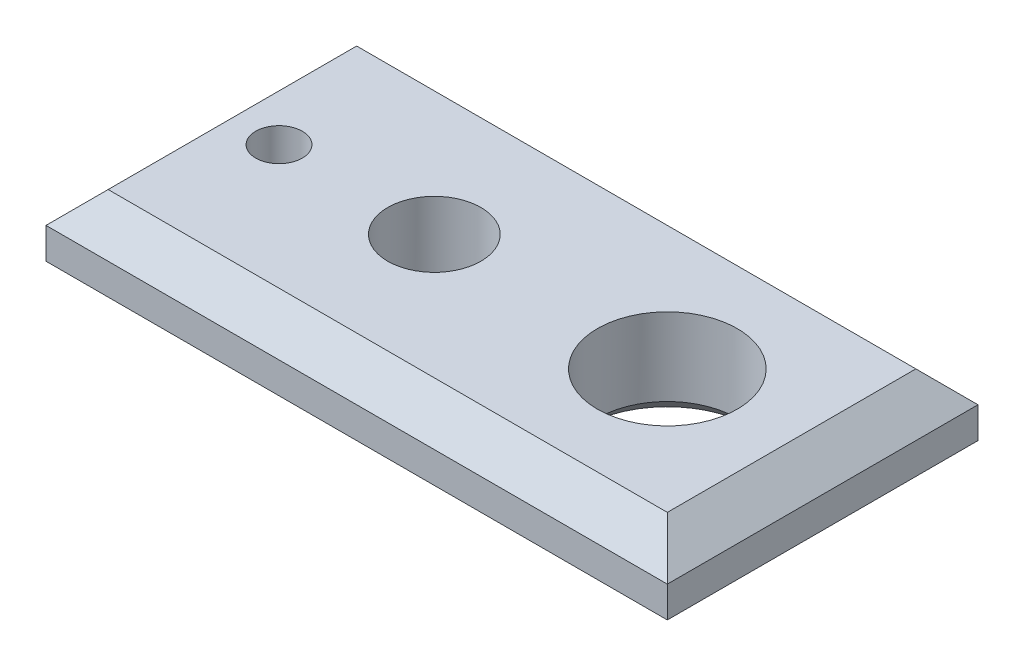
ISO-10303-21;
HEADER;
FILE_DESCRIPTION(('STEP AP214'),'2;1');
FILE_NAME('part.step','',(''),(''),'','','');
FILE_SCHEMA(('AUTOMOTIVE_DESIGN { 1 0 10303 214 1 1 1 1 }'));
ENDSEC;
DATA;
#1=APPLICATION_CONTEXT('core data for automotive mechanical design processes');
#2=APPLICATION_PROTOCOL_DEFINITION('international standard','automotive_design',2000,#1);
#3=PRODUCT_CONTEXT('',#1,'mechanical');
#4=PRODUCT('Part','Part','',(#3));
#5=PRODUCT_RELATED_PRODUCT_CATEGORY('part','',(#4));
#6=PRODUCT_DEFINITION_FORMATION('','',#4);
#7=PRODUCT_DEFINITION_CONTEXT('part definition',#1,'design');
#8=PRODUCT_DEFINITION('design','',#6,#7);
#9=PRODUCT_DEFINITION_SHAPE('','',#8);
#10=(LENGTH_UNIT() NAMED_UNIT(*) SI_UNIT(.MILLI.,.METRE.));
#11=(NAMED_UNIT(*) PLANE_ANGLE_UNIT() SI_UNIT($,.RADIAN.));
#12=(NAMED_UNIT(*) SI_UNIT($,.STERADIAN.) SOLID_ANGLE_UNIT());
#13=UNCERTAINTY_MEASURE_WITH_UNIT(LENGTH_MEASURE(1.E-05),#10,'distance_accuracy_value','');
#14=(GEOMETRIC_REPRESENTATION_CONTEXT(3) GLOBAL_UNCERTAINTY_ASSIGNED_CONTEXT((#13)) GLOBAL_UNIT_ASSIGNED_CONTEXT((#10,
#11,#12)) REPRESENTATION_CONTEXT('',''));
#15=CARTESIAN_POINT('',(0.,0.,0.));
#16=DIRECTION('',(0.,0.,1.));
#17=DIRECTION('',(1.,0.,0.));
#18=AXIS2_PLACEMENT_3D('',#15,#16,#17);
#19=CARTESIAN_POINT('',(100.,30.,50.));
#20=DIRECTION('',(-1.,0.,0.));
#21=DIRECTION('',(0.,0.,1.));
#22=AXIS2_PLACEMENT_3D('',#19,#20,#21);
#23=PLANE('',#22);
#24=DIRECTION('',(0.,-1.,0.));
#25=VECTOR('',#24,1.);
#26=CARTESIAN_POINT('',(100.,30.,50.));
#27=LINE('',#26,#25);
#28=CARTESIAN_POINT('',(100.,19.9999999999999,50.));
#29=VERTEX_POINT('',#28);
#30=CARTESIAN_POINT('',(100.,9.99999999999998,50.));
#31=VERTEX_POINT('',#30);
#32=EDGE_CURVE('E214',#29,#31,#27,.T.);
#33=ORIENTED_EDGE('',*,*,#32,.T.);
#34=DIRECTION('',(0.,0.,-1.));
#35=VECTOR('',#34,1.);
#36=CARTESIAN_POINT('',(100.,9.99999999999998,-50.));
#37=LINE('',#36,#35);
#38=CARTESIAN_POINT('',(100.,9.99999999999998,-50.));
#39=VERTEX_POINT('',#38);
#40=EDGE_CURVE('E202',#31,#39,#37,.T.);
#41=ORIENTED_EDGE('',*,*,#40,.T.);
#42=DIRECTION('',(0.,-1.,0.));
#43=VECTOR('',#42,1.);
#44=CARTESIAN_POINT('',(100.,30.,-50.));
#45=LINE('',#44,#43);
#46=CARTESIAN_POINT('',(100.,19.9999999999999,-50.));
#47=VERTEX_POINT('',#46);
#48=EDGE_CURVE('E123',#47,#39,#45,.T.);
#49=ORIENTED_EDGE('',*,*,#48,.F.);
#50=DIRECTION('',(0.,0.,1.));
#51=VECTOR('',#50,1.);
#52=CARTESIAN_POINT('',(100.,19.9999999999999,50.));
#53=LINE('',#52,#51);
#54=EDGE_CURVE('E200',#47,#29,#53,.T.);
#55=ORIENTED_EDGE('',*,*,#54,.T.);
#56=EDGE_LOOP('',(#33,#41,#49,#55));
#57=FACE_BOUND('',#56,.T.);
#58=ADVANCED_FACE('F35',(#57),#23,.F.);
#59=CARTESIAN_POINT('',(-100.,30.,-50.));
#60=DIRECTION('',(0.,0.,1.));
#61=DIRECTION('',(1.,0.,0.));
#62=AXIS2_PLACEMENT_3D('',#59,#60,#61);
#63=PLANE('',#62);
#64=ORIENTED_EDGE('',*,*,#48,.T.);
#65=DIRECTION('',(-1.,0.,0.));
#66=VECTOR('',#65,1.);
#67=CARTESIAN_POINT('',(-100.,9.99999999999998,-50.));
#68=LINE('',#67,#66);
#69=CARTESIAN_POINT('',(-100.,9.99999999999998,-50.));
#70=VERTEX_POINT('',#69);
#71=EDGE_CURVE('E122',#39,#70,#68,.T.);
#72=ORIENTED_EDGE('',*,*,#71,.T.);
#73=DIRECTION('',(0.,-1.,0.));
#74=VECTOR('',#73,1.);
#75=CARTESIAN_POINT('',(-100.,30.,-50.));
#76=LINE('',#75,#74);
#77=CARTESIAN_POINT('',(-100.,19.9999999999999,-50.));
#78=VERTEX_POINT('',#77);
#79=EDGE_CURVE('E105',#78,#70,#76,.T.);
#80=ORIENTED_EDGE('',*,*,#79,.F.);
#81=DIRECTION('',(1.,0.,0.));
#82=VECTOR('',#81,1.);
#83=CARTESIAN_POINT('',(-100.,19.9999999999999,-50.));
#84=LINE('',#83,#82);
#85=EDGE_CURVE('E119',#78,#47,#84,.T.);
#86=ORIENTED_EDGE('',*,*,#85,.T.);
#87=EDGE_LOOP('',(#64,#72,#80,#86));
#88=FACE_BOUND('',#87,.T.);
#89=ADVANCED_FACE('F118',(#88),#63,.F.);
#90=CARTESIAN_POINT('',(-100.,30.,50.));
#91=DIRECTION('',(1.,0.,0.));
#92=DIRECTION('',(0.,0.,-1.));
#93=AXIS2_PLACEMENT_3D('',#90,#91,#92);
#94=PLANE('',#93);
#95=ORIENTED_EDGE('',*,*,#79,.T.);
#96=DIRECTION('',(0.,0.,1.));
#97=VECTOR('',#96,1.);
#98=CARTESIAN_POINT('',(-100.,9.99999999999998,50.));
#99=LINE('',#98,#97);
#100=CARTESIAN_POINT('',(-100.,9.99999999999998,50.));
#101=VERTEX_POINT('',#100);
#102=EDGE_CURVE('E111',#70,#101,#99,.T.);
#103=ORIENTED_EDGE('',*,*,#102,.T.);
#104=DIRECTION('',(0.,-1.,0.));
#105=VECTOR('',#104,1.);
#106=CARTESIAN_POINT('',(-100.,30.,50.));
#107=LINE('',#106,#105);
#108=CARTESIAN_POINT('',(-100.,19.9999999999999,50.));
#109=VERTEX_POINT('',#108);
#110=EDGE_CURVE('E107',#109,#101,#107,.T.);
#111=ORIENTED_EDGE('',*,*,#110,.F.);
#112=DIRECTION('',(0.,0.,-1.));
#113=VECTOR('',#112,1.);
#114=CARTESIAN_POINT('',(-100.,19.9999999999999,50.));
#115=LINE('',#114,#113);
#116=EDGE_CURVE('E102',#109,#78,#115,.T.);
#117=ORIENTED_EDGE('',*,*,#116,.T.);
#118=EDGE_LOOP('',(#95,#103,#111,#117));
#119=FACE_BOUND('',#118,.T.);
#120=ADVANCED_FACE('F104',(#119),#94,.F.);
#121=CARTESIAN_POINT('',(-100.,30.,50.));
#122=DIRECTION('',(0.,0.,-1.));
#123=DIRECTION('',(-1.,0.,0.));
#124=AXIS2_PLACEMENT_3D('',#121,#122,#123);
#125=PLANE('',#124);
#126=ORIENTED_EDGE('',*,*,#110,.T.);
#127=DIRECTION('',(1.,0.,0.));
#128=VECTOR('',#127,1.);
#129=CARTESIAN_POINT('',(100.,9.99999999999998,50.));
#130=LINE('',#129,#128);
#131=EDGE_CURVE('E196',#101,#31,#130,.T.);
#132=ORIENTED_EDGE('',*,*,#131,.T.);
#133=ORIENTED_EDGE('',*,*,#32,.F.);
#134=DIRECTION('',(-1.,0.,0.));
#135=VECTOR('',#134,1.);
#136=CARTESIAN_POINT('',(-100.,19.9999999999999,50.));
#137=LINE('',#136,#135);
#138=EDGE_CURVE('E194',#29,#109,#137,.T.);
#139=ORIENTED_EDGE('',*,*,#138,.T.);
#140=EDGE_LOOP('',(#126,#132,#133,#139));
#141=FACE_BOUND('',#140,.T.);
#142=ADVANCED_FACE('F230',(#141),#125,.F.);
#143=CARTESIAN_POINT('',(0.,30.,0.));
#144=DIRECTION('',(0.,-1.,0.));
#145=DIRECTION('',(0.,0.,-1.));
#146=AXIS2_PLACEMENT_3D('',#143,#144,#145);
#147=PLANE('',#146);
#148=CARTESIAN_POINT('',(-75.,30.,0.));
#149=DIRECTION('',(0.,1.,0.));
#150=DIRECTION('',(0.,0.,1.));
#151=AXIS2_PLACEMENT_3D('',#148,#149,#150);
#152=CIRCLE('',#151,7.50000000000001);
#153=CARTESIAN_POINT('',(-75.,30.,7.50000000000001));
#154=VERTEX_POINT('',#153);
#155=EDGE_CURVE('E216',#154,#154,#152,.T.);
#156=ORIENTED_EDGE('',*,*,#155,.F.);
#157=EDGE_LOOP('',(#156));
#158=FACE_BOUND('',#157,.T.);
#159=CARTESIAN_POINT('',(-25.,30.,0.));
#160=DIRECTION('',(0.,1.,0.));
#161=DIRECTION('',(0.,0.,1.));
#162=AXIS2_PLACEMENT_3D('',#159,#160,#161);
#163=CIRCLE('',#162,15.);
#164=CARTESIAN_POINT('',(-25.,30.,15.));
#165=VERTEX_POINT('',#164);
#166=EDGE_CURVE('E323',#165,#165,#163,.T.);
#167=ORIENTED_EDGE('',*,*,#166,.F.);
#168=EDGE_LOOP('',(#167));
#169=FACE_BOUND('',#168,.T.);
#170=CARTESIAN_POINT('',(50.,30.,0.));
#171=DIRECTION('',(0.,1.,0.));
#172=DIRECTION('',(0.,0.,1.));
#173=AXIS2_PLACEMENT_3D('',#170,#171,#172);
#174=CIRCLE('',#173,22.5);
#175=CARTESIAN_POINT('',(50.,30.,22.5));
#176=VERTEX_POINT('',#175);
#177=EDGE_CURVE('E235',#176,#176,#174,.T.);
#178=ORIENTED_EDGE('',*,*,#177,.F.);
#179=EDGE_LOOP('',(#178));
#180=FACE_BOUND('',#179,.T.);
#181=DIRECTION('',(0.,0.,1.));
#182=VECTOR('',#181,1.);
#183=CARTESIAN_POINT('',(-90.,30.,0.));
#184=LINE('',#183,#182);
#185=CARTESIAN_POINT('',(-90.,30.,-40.));
#186=VERTEX_POINT('',#185);
#187=CARTESIAN_POINT('',(-90.,30.,40.));
#188=VERTEX_POINT('',#187);
#189=EDGE_CURVE('E51',#186,#188,#184,.T.);
#190=ORIENTED_EDGE('',*,*,#189,.T.);
#191=DIRECTION('',(1.,0.,0.));
#192=VECTOR('',#191,1.);
#193=CARTESIAN_POINT('',(0.,30.,40.));
#194=LINE('',#193,#192);
#195=CARTESIAN_POINT('',(90.,30.,40.));
#196=VERTEX_POINT('',#195);
#197=EDGE_CURVE('E146',#188,#196,#194,.T.);
#198=ORIENTED_EDGE('',*,*,#197,.T.);
#199=DIRECTION('',(0.,0.,-1.));
#200=VECTOR('',#199,1.);
#201=CARTESIAN_POINT('',(90.,30.,0.));
#202=LINE('',#201,#200);
#203=CARTESIAN_POINT('',(90.,30.,-40.));
#204=VERTEX_POINT('',#203);
#205=EDGE_CURVE('E204',#196,#204,#202,.T.);
#206=ORIENTED_EDGE('',*,*,#205,.T.);
#207=DIRECTION('',(-1.,0.,0.));
#208=VECTOR('',#207,1.);
#209=CARTESIAN_POINT('',(0.,30.,-40.));
#210=LINE('',#209,#208);
#211=EDGE_CURVE('E56',#204,#186,#210,.T.);
#212=ORIENTED_EDGE('',*,*,#211,.T.);
#213=EDGE_LOOP('',(#190,#198,#206,#212));
#214=FACE_BOUND('',#213,.T.);
#215=ADVANCED_FACE('F170',(#158,#169,#180,#214),#147,.F.);
#216=CARTESIAN_POINT('',(0.,0.,0.));
#217=DIRECTION('',(0.,-1.,0.));
#218=DIRECTION('',(0.,0.,-1.));
#219=AXIS2_PLACEMENT_3D('',#216,#217,#218);
#220=PLANE('',#219);
#221=CARTESIAN_POINT('',(50.,0.,0.));
#222=DIRECTION('',(0.,-1.,0.));
#223=DIRECTION('',(0.,0.,-1.));
#224=AXIS2_PLACEMENT_3D('',#221,#222,#223);
#225=CIRCLE('',#224,27.5);
#226=CARTESIAN_POINT('',(50.,0.,-27.5));
#227=VERTEX_POINT('',#226);
#228=EDGE_CURVE('E149',#227,#227,#225,.F.);
#229=ORIENTED_EDGE('',*,*,#228,.T.);
#230=EDGE_LOOP('',(#229));
#231=FACE_BOUND('',#230,.T.);
#232=CARTESIAN_POINT('',(-25.,0.,0.));
#233=DIRECTION('',(0.,-1.,0.));
#234=DIRECTION('',(0.,0.,-1.));
#235=AXIS2_PLACEMENT_3D('',#232,#233,#234);
#236=CIRCLE('',#235,20.);
#237=CARTESIAN_POINT('',(-25.,0.,-20.));
#238=VERTEX_POINT('',#237);
#239=EDGE_CURVE('E145',#238,#238,#236,.F.);
#240=ORIENTED_EDGE('',*,*,#239,.T.);
#241=EDGE_LOOP('',(#240));
#242=FACE_BOUND('',#241,.T.);
#243=CARTESIAN_POINT('',(-75.,0.,0.));
#244=DIRECTION('',(0.,-1.,0.));
#245=DIRECTION('',(0.,0.,-1.));
#246=AXIS2_PLACEMENT_3D('',#243,#244,#245);
#247=CIRCLE('',#246,12.5);
#248=CARTESIAN_POINT('',(-75.,0.,-12.5));
#249=VERTEX_POINT('',#248);
#250=EDGE_CURVE('E142',#249,#249,#247,.F.);
#251=ORIENTED_EDGE('',*,*,#250,.T.);
#252=EDGE_LOOP('',(#251));
#253=FACE_BOUND('',#252,.T.);
#254=DIRECTION('',(0.,0.,-1.));
#255=VECTOR('',#254,1.);
#256=CARTESIAN_POINT('',(-90.,0.,-50.));
#257=LINE('',#256,#255);
#258=CARTESIAN_POINT('',(-90.,0.,40.));
#259=VERTEX_POINT('',#258);
#260=CARTESIAN_POINT('',(-90.,0.,-40.));
#261=VERTEX_POINT('',#260);
#262=EDGE_CURVE('E177',#259,#261,#257,.T.);
#263=ORIENTED_EDGE('',*,*,#262,.T.);
#264=DIRECTION('',(1.,0.,0.));
#265=VECTOR('',#264,1.);
#266=CARTESIAN_POINT('',(100.,0.,-40.));
#267=LINE('',#266,#265);
#268=CARTESIAN_POINT('',(90.,0.,-40.));
#269=VERTEX_POINT('',#268);
#270=EDGE_CURVE('E112',#261,#269,#267,.T.);
#271=ORIENTED_EDGE('',*,*,#270,.T.);
#272=DIRECTION('',(0.,0.,1.));
#273=VECTOR('',#272,1.);
#274=CARTESIAN_POINT('',(90.,0.,50.));
#275=LINE('',#274,#273);
#276=CARTESIAN_POINT('',(90.,0.,40.));
#277=VERTEX_POINT('',#276);
#278=EDGE_CURVE('E240',#269,#277,#275,.T.);
#279=ORIENTED_EDGE('',*,*,#278,.T.);
#280=DIRECTION('',(-1.,0.,0.));
#281=VECTOR('',#280,1.);
#282=CARTESIAN_POINT('',(-100.,0.,40.));
#283=LINE('',#282,#281);
#284=EDGE_CURVE('E180',#277,#259,#283,.T.);
#285=ORIENTED_EDGE('',*,*,#284,.T.);
#286=EDGE_LOOP('',(#263,#271,#279,#285));
#287=FACE_BOUND('',#286,.T.);
#288=ADVANCED_FACE('F166',(#231,#242,#253,#287),#220,.T.);
#289=CARTESIAN_POINT('',(-100.,9.99999999999998,50.));
#290=DIRECTION('',(0.,-0.707106781186548,0.707106781186547));
#291=DIRECTION('',(-1.,0.,0.));
#292=AXIS2_PLACEMENT_3D('',#289,#290,#291);
#293=PLANE('',#292);
#294=DIRECTION('',(0.577350269189626,-0.577350269189625,-0.577350269189626));
#295=VECTOR('',#294,1.);
#296=CARTESIAN_POINT('',(-100.,9.99999999999998,50.));
#297=LINE('',#296,#295);
#298=EDGE_CURVE('E193',#259,#101,#297,.F.);
#299=ORIENTED_EDGE('',*,*,#298,.F.);
#300=ORIENTED_EDGE('',*,*,#284,.F.);
#301=DIRECTION('',(-0.577350269189626,-0.577350269189625,-0.577350269189626));
#302=VECTOR('',#301,1.);
#303=CARTESIAN_POINT('',(100.,9.99999999999998,50.));
#304=LINE('',#303,#302);
#305=EDGE_CURVE('E211',#31,#277,#304,.T.);
#306=ORIENTED_EDGE('',*,*,#305,.F.);
#307=ORIENTED_EDGE('',*,*,#131,.F.);
#308=EDGE_LOOP('',(#299,#300,#306,#307));
#309=FACE_BOUND('',#308,.T.);
#310=ADVANCED_FACE('F169',(#309),#293,.T.);
#311=CARTESIAN_POINT('',(100.,9.99999999999998,50.));
#312=DIRECTION('',(0.707106781186546,-0.707106781186548,0.));
#313=DIRECTION('',(0.,0.,1.));
#314=AXIS2_PLACEMENT_3D('',#311,#312,#313);
#315=PLANE('',#314);
#316=ORIENTED_EDGE('',*,*,#305,.T.);
#317=ORIENTED_EDGE('',*,*,#278,.F.);
#318=DIRECTION('',(0.577350269189626,0.577350269189625,-0.577350269189626));
#319=VECTOR('',#318,1.);
#320=CARTESIAN_POINT('',(66.6666666666666,-23.3333333333333,-16.6666666666666));
#321=LINE('',#320,#319);
#322=EDGE_CURVE('E136',#39,#269,#321,.F.);
#323=ORIENTED_EDGE('',*,*,#322,.F.);
#324=ORIENTED_EDGE('',*,*,#40,.F.);
#325=EDGE_LOOP('',(#316,#317,#323,#324));
#326=FACE_BOUND('',#325,.T.);
#327=ADVANCED_FACE('F245',(#326),#315,.T.);
#328=CARTESIAN_POINT('',(-100.,9.99999999999998,50.));
#329=DIRECTION('',(-0.707106781186546,-0.707106781186548,0.));
#330=DIRECTION('',(0.,0.,-1.));
#331=AXIS2_PLACEMENT_3D('',#328,#329,#330);
#332=PLANE('',#331);
#333=ORIENTED_EDGE('',*,*,#298,.T.);
#334=ORIENTED_EDGE('',*,*,#102,.F.);
#335=DIRECTION('',(0.577350269189626,-0.577350269189625,0.577350269189626));
#336=VECTOR('',#335,1.);
#337=CARTESIAN_POINT('',(-66.6666666666666,-23.3333333333333,-16.6666666666666));
#338=LINE('',#337,#336);
#339=EDGE_CURVE('E134',#261,#70,#338,.F.);
#340=ORIENTED_EDGE('',*,*,#339,.F.);
#341=ORIENTED_EDGE('',*,*,#262,.F.);
#342=EDGE_LOOP('',(#333,#334,#340,#341));
#343=FACE_BOUND('',#342,.T.);
#344=ADVANCED_FACE('F192',(#343),#332,.T.);
#345=CARTESIAN_POINT('',(-100.,9.99999999999998,-50.));
#346=DIRECTION('',(0.,-0.707106781186548,-0.707106781186547));
#347=DIRECTION('',(1.,0.,0.));
#348=AXIS2_PLACEMENT_3D('',#345,#346,#347);
#349=PLANE('',#348);
#350=ORIENTED_EDGE('',*,*,#322,.T.);
#351=ORIENTED_EDGE('',*,*,#270,.F.);
#352=ORIENTED_EDGE('',*,*,#339,.T.);
#353=ORIENTED_EDGE('',*,*,#71,.F.);
#354=EDGE_LOOP('',(#350,#351,#352,#353));
#355=FACE_BOUND('',#354,.T.);
#356=ADVANCED_FACE('F187',(#355),#349,.T.);
#357=CARTESIAN_POINT('',(0.,30.,-40.));
#358=DIRECTION('',(0.,-0.707106781186545,0.70710678118655));
#359=DIRECTION('',(-1.,0.,0.));
#360=AXIS2_PLACEMENT_3D('',#357,#358,#359);
#361=PLANE('',#360);
#362=DIRECTION('',(-0.577350269189625,0.577350269189628,0.577350269189624));
#363=VECTOR('',#362,1.);
#364=CARTESIAN_POINT('',(76.6666666666667,43.3333333333334,-26.6666666666667));
#365=LINE('',#364,#363);
#366=EDGE_CURVE('E130',#47,#204,#365,.T.);
#367=ORIENTED_EDGE('',*,*,#366,.F.);
#368=ORIENTED_EDGE('',*,*,#85,.F.);
#369=DIRECTION('',(0.577350269189625,0.577350269189628,0.577350269189624));
#370=VECTOR('',#369,1.);
#371=CARTESIAN_POINT('',(-60.0000000000001,60.0000000000001,-10.0000000000001));
#372=LINE('',#371,#370);
#373=EDGE_CURVE('E128',#186,#78,#372,.F.);
#374=ORIENTED_EDGE('',*,*,#373,.F.);
#375=ORIENTED_EDGE('',*,*,#211,.F.);
#376=EDGE_LOOP('',(#367,#368,#374,#375));
#377=FACE_BOUND('',#376,.T.);
#378=ADVANCED_FACE('F127',(#377),#361,.F.);
#379=CARTESIAN_POINT('',(-90.,30.,0.));
#380=DIRECTION('',(0.707106781186549,-0.707106781186545,0.));
#381=DIRECTION('',(0.,0.,1.));
#382=AXIS2_PLACEMENT_3D('',#379,#380,#381);
#383=PLANE('',#382);
#384=ORIENTED_EDGE('',*,*,#373,.T.);
#385=ORIENTED_EDGE('',*,*,#116,.F.);
#386=DIRECTION('',(0.577350269189625,0.577350269189628,-0.577350269189624));
#387=VECTOR('',#386,1.);
#388=CARTESIAN_POINT('',(-76.6666666666667,43.3333333333333,26.6666666666667));
#389=LINE('',#388,#387);
#390=EDGE_CURVE('E138',#188,#109,#389,.F.);
#391=ORIENTED_EDGE('',*,*,#390,.F.);
#392=ORIENTED_EDGE('',*,*,#189,.F.);
#393=EDGE_LOOP('',(#384,#385,#391,#392));
#394=FACE_BOUND('',#393,.T.);
#395=ADVANCED_FACE('F133',(#394),#383,.F.);
#396=CARTESIAN_POINT('',(90.,30.,0.));
#397=DIRECTION('',(-0.707106781186549,-0.707106781186545,0.));
#398=DIRECTION('',(0.,0.,-1.));
#399=AXIS2_PLACEMENT_3D('',#396,#397,#398);
#400=PLANE('',#399);
#401=ORIENTED_EDGE('',*,*,#366,.T.);
#402=ORIENTED_EDGE('',*,*,#205,.F.);
#403=DIRECTION('',(0.577350269189625,-0.577350269189628,0.577350269189624));
#404=VECTOR('',#403,1.);
#405=CARTESIAN_POINT('',(76.6666666666667,43.3333333333333,26.6666666666667));
#406=LINE('',#405,#404);
#407=EDGE_CURVE('E215',#29,#196,#406,.F.);
#408=ORIENTED_EDGE('',*,*,#407,.F.);
#409=ORIENTED_EDGE('',*,*,#54,.F.);
#410=EDGE_LOOP('',(#401,#402,#408,#409));
#411=FACE_BOUND('',#410,.T.);
#412=ADVANCED_FACE('F224',(#411),#400,.F.);
#413=CARTESIAN_POINT('',(0.,30.,40.));
#414=DIRECTION('',(0.,-0.707106781186545,-0.70710678118655));
#415=DIRECTION('',(1.,0.,0.));
#416=AXIS2_PLACEMENT_3D('',#413,#414,#415);
#417=PLANE('',#416);
#418=ORIENTED_EDGE('',*,*,#390,.T.);
#419=ORIENTED_EDGE('',*,*,#138,.F.);
#420=ORIENTED_EDGE('',*,*,#407,.T.);
#421=ORIENTED_EDGE('',*,*,#197,.F.);
#422=EDGE_LOOP('',(#418,#419,#420,#421));
#423=FACE_BOUND('',#422,.T.);
#424=ADVANCED_FACE('F220',(#423),#417,.F.);
#425=CARTESIAN_POINT('',(50.,-0.001000000000001,0.));
#426=DIRECTION('',(0.,1.,0.));
#427=DIRECTION('',(0.,0.,1.));
#428=AXIS2_PLACEMENT_3D('',#425,#426,#427);
#429=CYLINDRICAL_SURFACE('',#428,22.5);
#430=CARTESIAN_POINT('',(50.,5.00000000000003,0.));
#431=DIRECTION('',(0.,-1.,0.));
#432=DIRECTION('',(0.,0.,-1.));
#433=AXIS2_PLACEMENT_3D('',#430,#431,#432);
#434=CIRCLE('',#433,22.5);
#435=CARTESIAN_POINT('',(50.,5.00000000000003,-22.5));
#436=VERTEX_POINT('',#435);
#437=EDGE_CURVE('E152',#436,#436,#434,.T.);
#438=ORIENTED_EDGE('',*,*,#437,.T.);
#439=EDGE_LOOP('',(#438));
#440=FACE_BOUND('',#439,.T.);
#441=ORIENTED_EDGE('',*,*,#177,.T.);
#442=EDGE_LOOP('',(#441));
#443=FACE_BOUND('',#442,.T.);
#444=ADVANCED_FACE('F284',(#440,#443),#429,.F.);
#445=CARTESIAN_POINT('',(-25.,-0.001000000000001,0.));
#446=DIRECTION('',(0.,1.,0.));
#447=DIRECTION('',(0.,0.,1.));
#448=AXIS2_PLACEMENT_3D('',#445,#446,#447);
#449=CYLINDRICAL_SURFACE('',#448,15.);
#450=CARTESIAN_POINT('',(-25.,4.99999999999999,0.));
#451=DIRECTION('',(0.,-1.,0.));
#452=DIRECTION('',(0.,0.,-1.));
#453=AXIS2_PLACEMENT_3D('',#450,#451,#452);
#454=CIRCLE('',#453,15.);
#455=CARTESIAN_POINT('',(-25.,4.99999999999999,-15.));
#456=VERTEX_POINT('',#455);
#457=EDGE_CURVE('E44',#456,#456,#454,.T.);
#458=ORIENTED_EDGE('',*,*,#457,.T.);
#459=EDGE_LOOP('',(#458));
#460=FACE_BOUND('',#459,.T.);
#461=ORIENTED_EDGE('',*,*,#166,.T.);
#462=EDGE_LOOP('',(#461));
#463=FACE_BOUND('',#462,.T.);
#464=ADVANCED_FACE('F157',(#460,#463),#449,.F.);
#465=CARTESIAN_POINT('',(-75.,-0.001000000000001,0.));
#466=DIRECTION('',(0.,1.,0.));
#467=DIRECTION('',(0.,0.,1.));
#468=AXIS2_PLACEMENT_3D('',#465,#466,#467);
#469=CYLINDRICAL_SURFACE('',#468,7.50000000000001);
#470=CARTESIAN_POINT('',(-75.,5.00000000000003,0.));
#471=DIRECTION('',(0.,-1.,0.));
#472=DIRECTION('',(0.,0.,-1.));
#473=AXIS2_PLACEMENT_3D('',#470,#471,#472);
#474=CIRCLE('',#473,7.50000000000001);
#475=CARTESIAN_POINT('',(-75.,5.00000000000003,-7.50000000000001));
#476=VERTEX_POINT('',#475);
#477=EDGE_CURVE('E11',#476,#476,#474,.T.);
#478=ORIENTED_EDGE('',*,*,#477,.T.);
#479=EDGE_LOOP('',(#478));
#480=FACE_BOUND('',#479,.T.);
#481=ORIENTED_EDGE('',*,*,#155,.T.);
#482=EDGE_LOOP('',(#481));
#483=FACE_BOUND('',#482,.T.);
#484=ADVANCED_FACE('F302',(#480,#483),#469,.F.);
#485=CARTESIAN_POINT('',(50.,0.,0.));
#486=DIRECTION('',(0.,-1.,0.));
#487=DIRECTION('',(0.,0.,-1.));
#488=AXIS2_PLACEMENT_3D('',#485,#486,#487);
#489=CONICAL_SURFACE('',#488,27.5,0.785398163397448);
#490=ORIENTED_EDGE('',*,*,#437,.F.);
#491=EDGE_LOOP('',(#490));
#492=FACE_BOUND('',#491,.T.);
#493=ORIENTED_EDGE('',*,*,#228,.F.);
#494=EDGE_LOOP('',(#493));
#495=FACE_BOUND('',#494,.T.);
#496=ADVANCED_FACE('F163',(#492,#495),#489,.F.);
#497=CARTESIAN_POINT('',(-25.,0.,0.));
#498=DIRECTION('',(0.,-1.,0.));
#499=DIRECTION('',(0.,0.,-1.));
#500=AXIS2_PLACEMENT_3D('',#497,#498,#499);
#501=CONICAL_SURFACE('',#500,20.,0.785398163397448);
#502=ORIENTED_EDGE('',*,*,#457,.F.);
#503=EDGE_LOOP('',(#502));
#504=FACE_BOUND('',#503,.T.);
#505=ORIENTED_EDGE('',*,*,#239,.F.);
#506=EDGE_LOOP('',(#505));
#507=FACE_BOUND('',#506,.T.);
#508=ADVANCED_FACE('F160',(#504,#507),#501,.F.);
#509=CARTESIAN_POINT('',(-75.,0.,0.));
#510=DIRECTION('',(0.,-1.,0.));
#511=DIRECTION('',(0.,0.,-1.));
#512=AXIS2_PLACEMENT_3D('',#509,#510,#511);
#513=CONICAL_SURFACE('',#512,12.5,0.785398163397448);
#514=ORIENTED_EDGE('',*,*,#477,.F.);
#515=EDGE_LOOP('',(#514));
#516=FACE_BOUND('',#515,.T.);
#517=ORIENTED_EDGE('',*,*,#250,.F.);
#518=EDGE_LOOP('',(#517));
#519=FACE_BOUND('',#518,.T.);
#520=ADVANCED_FACE('F38',(#516,#519),#513,.F.);
#521=CLOSED_SHELL('',(#58,#89,#120,#142,#215,#288,#310,#327,#344,#356,#378,#395,#412,#424,#444,
#464,#484,#496,#508,#520));
#522=MANIFOLD_SOLID_BREP('B2',#521);
#523=ADVANCED_BREP_SHAPE_REPRESENTATION('',(#18,#522),#14);
#524=SHAPE_DEFINITION_REPRESENTATION(#9,#523);
ENDSEC;
END-ISO-10303-21;
